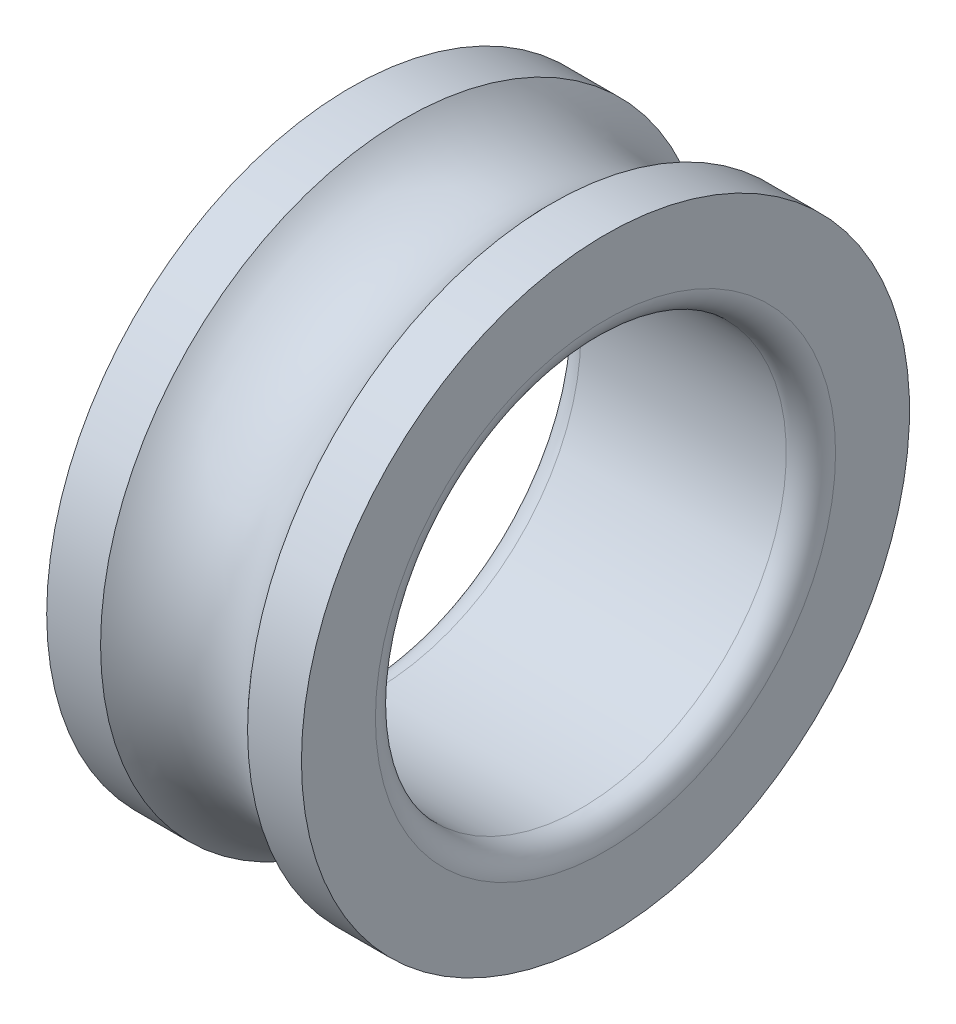
ISO-10303-21;
HEADER;
FILE_DESCRIPTION(('STEP AP214'),'2;1');
FILE_NAME('part.step','',(''),(''),'','','');
FILE_SCHEMA(('AUTOMOTIVE_DESIGN { 1 0 10303 214 1 1 1 1 }'));
ENDSEC;
DATA;
#1=APPLICATION_CONTEXT('core data for automotive mechanical design processes');
#2=APPLICATION_PROTOCOL_DEFINITION('international standard','automotive_design',2000,#1);
#3=PRODUCT_CONTEXT('',#1,'mechanical');
#4=PRODUCT('Part','Part','',(#3));
#5=PRODUCT_RELATED_PRODUCT_CATEGORY('part','',(#4));
#6=PRODUCT_DEFINITION_FORMATION('','',#4);
#7=PRODUCT_DEFINITION_CONTEXT('part definition',#1,'design');
#8=PRODUCT_DEFINITION('design','',#6,#7);
#9=PRODUCT_DEFINITION_SHAPE('','',#8);
#10=(LENGTH_UNIT() NAMED_UNIT(*) SI_UNIT(.MILLI.,.METRE.));
#11=(NAMED_UNIT(*) PLANE_ANGLE_UNIT() SI_UNIT($,.RADIAN.));
#12=(NAMED_UNIT(*) SI_UNIT($,.STERADIAN.) SOLID_ANGLE_UNIT());
#13=UNCERTAINTY_MEASURE_WITH_UNIT(LENGTH_MEASURE(1.E-05),#10,'distance_accuracy_value','');
#14=(GEOMETRIC_REPRESENTATION_CONTEXT(3) GLOBAL_UNCERTAINTY_ASSIGNED_CONTEXT((#13)) GLOBAL_UNIT_ASSIGNED_CONTEXT((#10,
#11,#12)) REPRESENTATION_CONTEXT('',''));
#15=CARTESIAN_POINT('',(0.,0.,0.));
#16=DIRECTION('',(0.,0.,1.));
#17=DIRECTION('',(1.,0.,0.));
#18=AXIS2_PLACEMENT_3D('',#15,#16,#17);
#19=CARTESIAN_POINT('',(-22.6163522012579,0.,0.));
#20=DIRECTION('',(-1.,0.,0.));
#21=DIRECTION('',(0.,0.,1.));
#22=AXIS2_PLACEMENT_3D('',#19,#20,#21);
#23=CYLINDRICAL_SURFACE('',#22,37.);
#24=CARTESIAN_POINT('',(8.94427190999914,0.,0.));
#25=DIRECTION('',(-1.,0.,0.));
#26=DIRECTION('',(0.,0.,1.));
#27=AXIS2_PLACEMENT_3D('',#24,#25,#26);
#28=CIRCLE('',#27,37.);
#29=CARTESIAN_POINT('',(8.94427190999914,0.,37.));
#30=VERTEX_POINT('',#29);
#31=EDGE_CURVE('E61',#30,#30,#28,.T.);
#32=ORIENTED_EDGE('',*,*,#31,.F.);
#33=EDGE_LOOP('',(#32));
#34=FACE_BOUND('',#33,.T.);
#35=CARTESIAN_POINT('',(15.5,0.,0.));
#36=DIRECTION('',(-1.,0.,0.));
#37=DIRECTION('',(0.,0.,1.));
#38=AXIS2_PLACEMENT_3D('',#35,#36,#37);
#39=CIRCLE('',#38,37.);
#40=CARTESIAN_POINT('',(15.5,0.,37.));
#41=VERTEX_POINT('',#40);
#42=EDGE_CURVE('E73',#41,#41,#39,.T.);
#43=ORIENTED_EDGE('',*,*,#42,.T.);
#44=EDGE_LOOP('',(#43));
#45=FACE_BOUND('',#44,.T.);
#46=ADVANCED_FACE('F37',(#34,#45),#23,.T.);
#47=CARTESIAN_POINT('',(0.,0.,0.));
#48=DIRECTION('',(-1.,0.,0.));
#49=DIRECTION('',(0.,0.,1.));
#50=AXIS2_PLACEMENT_3D('',#47,#48,#49);
#51=TOROIDAL_SURFACE('',#50,45.,12.);
#52=CARTESIAN_POINT('',(-8.94427190999917,0.,0.));
#53=DIRECTION('',(-1.,0.,0.));
#54=DIRECTION('',(0.,0.,1.));
#55=AXIS2_PLACEMENT_3D('',#52,#53,#54);
#56=CIRCLE('',#55,37.);
#57=CARTESIAN_POINT('',(-8.94427190999917,0.,37.));
#58=VERTEX_POINT('',#57);
#59=EDGE_CURVE('E65',#58,#58,#56,.T.);
#60=ORIENTED_EDGE('',*,*,#59,.F.);
#61=EDGE_LOOP('',(#60));
#62=FACE_BOUND('',#61,.T.);
#63=ORIENTED_EDGE('',*,*,#31,.T.);
#64=EDGE_LOOP('',(#63));
#65=FACE_BOUND('',#64,.T.);
#66=ADVANCED_FACE('F93',(#62,#65),#51,.F.);
#67=CARTESIAN_POINT('',(-22.6163522012579,0.,0.));
#68=DIRECTION('',(-1.,0.,0.));
#69=DIRECTION('',(0.,0.,1.));
#70=AXIS2_PLACEMENT_3D('',#67,#68,#69);
#71=CYLINDRICAL_SURFACE('',#70,37.);
#72=CARTESIAN_POINT('',(-15.5,0.,0.));
#73=DIRECTION('',(-1.,0.,0.));
#74=DIRECTION('',(0.,0.,1.));
#75=AXIS2_PLACEMENT_3D('',#72,#73,#74);
#76=CIRCLE('',#75,37.);
#77=CARTESIAN_POINT('',(-15.5,0.,37.));
#78=VERTEX_POINT('',#77);
#79=EDGE_CURVE('E69',#78,#78,#76,.T.);
#80=ORIENTED_EDGE('',*,*,#79,.F.);
#81=EDGE_LOOP('',(#80));
#82=FACE_BOUND('',#81,.T.);
#83=ORIENTED_EDGE('',*,*,#59,.T.);
#84=EDGE_LOOP('',(#83));
#85=FACE_BOUND('',#84,.T.);
#86=ADVANCED_FACE('F99',(#82,#85),#71,.T.);
#87=CARTESIAN_POINT('',(-15.5,25.,0.));
#88=DIRECTION('',(1.,0.,0.));
#89=DIRECTION('',(0.,0.,-1.));
#90=AXIS2_PLACEMENT_3D('',#87,#88,#89);
#91=PLANE('',#90);
#92=CARTESIAN_POINT('',(-15.5,0.,0.));
#93=DIRECTION('',(1.,0.,0.));
#94=DIRECTION('',(0.,0.,-1.));
#95=AXIS2_PLACEMENT_3D('',#92,#93,#94);
#96=CIRCLE('',#95,28.);
#97=CARTESIAN_POINT('',(-15.5,0.,-28.));
#98=VERTEX_POINT('',#97);
#99=EDGE_CURVE('E45',#98,#98,#96,.T.);
#100=ORIENTED_EDGE('',*,*,#99,.T.);
#101=EDGE_LOOP('',(#100));
#102=FACE_BOUND('',#101,.T.);
#103=ORIENTED_EDGE('',*,*,#79,.T.);
#104=EDGE_LOOP('',(#103));
#105=FACE_BOUND('',#104,.T.);
#106=ADVANCED_FACE('F89',(#102,#105),#91,.F.);
#107=CARTESIAN_POINT('',(-22.6163522012579,0.,0.));
#108=DIRECTION('',(-1.,0.,0.));
#109=DIRECTION('',(0.,0.,1.));
#110=AXIS2_PLACEMENT_3D('',#107,#108,#109);
#111=CYLINDRICAL_SURFACE('',#110,25.);
#112=CARTESIAN_POINT('',(-12.5,0.,0.));
#113=DIRECTION('',(1.,0.,0.));
#114=DIRECTION('',(0.,0.,-1.));
#115=AXIS2_PLACEMENT_3D('',#112,#113,#114);
#116=CIRCLE('',#115,25.);
#117=CARTESIAN_POINT('',(-12.5,0.,-25.));
#118=VERTEX_POINT('',#117);
#119=EDGE_CURVE('E50',#118,#118,#116,.F.);
#120=ORIENTED_EDGE('',*,*,#119,.T.);
#121=EDGE_LOOP('',(#120));
#122=FACE_BOUND('',#121,.T.);
#123=CARTESIAN_POINT('',(12.5,0.,0.));
#124=DIRECTION('',(-1.,0.,0.));
#125=DIRECTION('',(0.,0.,1.));
#126=AXIS2_PLACEMENT_3D('',#123,#124,#125);
#127=CIRCLE('',#126,25.);
#128=CARTESIAN_POINT('',(12.5,0.,25.));
#129=VERTEX_POINT('',#128);
#130=EDGE_CURVE('E55',#129,#129,#127,.F.);
#131=ORIENTED_EDGE('',*,*,#130,.T.);
#132=EDGE_LOOP('',(#131));
#133=FACE_BOUND('',#132,.T.);
#134=ADVANCED_FACE('F82',(#122,#133),#111,.F.);
#135=CARTESIAN_POINT('',(15.5,25.,0.));
#136=DIRECTION('',(-1.,0.,0.));
#137=DIRECTION('',(0.,0.,1.));
#138=AXIS2_PLACEMENT_3D('',#135,#136,#137);
#139=PLANE('',#138);
#140=CARTESIAN_POINT('',(15.5,0.,0.));
#141=DIRECTION('',(-1.,0.,0.));
#142=DIRECTION('',(0.,0.,1.));
#143=AXIS2_PLACEMENT_3D('',#140,#141,#142);
#144=CIRCLE('',#143,28.);
#145=CARTESIAN_POINT('',(15.5,0.,28.));
#146=VERTEX_POINT('',#145);
#147=EDGE_CURVE('E10',#146,#146,#144,.T.);
#148=ORIENTED_EDGE('',*,*,#147,.T.);
#149=EDGE_LOOP('',(#148));
#150=FACE_BOUND('',#149,.T.);
#151=ORIENTED_EDGE('',*,*,#42,.F.);
#152=EDGE_LOOP('',(#151));
#153=FACE_BOUND('',#152,.T.);
#154=ADVANCED_FACE('F79',(#150,#153),#139,.F.);
#155=CARTESIAN_POINT('',(-12.5,0.,0.));
#156=DIRECTION('',(1.,0.,0.));
#157=DIRECTION('',(0.,0.,-1.));
#158=AXIS2_PLACEMENT_3D('',#155,#156,#157);
#159=TOROIDAL_SURFACE('',#158,28.,3.);
#160=ORIENTED_EDGE('',*,*,#99,.F.);
#161=EDGE_LOOP('',(#160));
#162=FACE_BOUND('',#161,.T.);
#163=ORIENTED_EDGE('',*,*,#119,.F.);
#164=EDGE_LOOP('',(#163));
#165=FACE_BOUND('',#164,.T.);
#166=ADVANCED_FACE('F81',(#162,#165),#159,.T.);
#167=CARTESIAN_POINT('',(12.5,0.,0.));
#168=DIRECTION('',(-1.,0.,0.));
#169=DIRECTION('',(0.,0.,1.));
#170=AXIS2_PLACEMENT_3D('',#167,#168,#169);
#171=TOROIDAL_SURFACE('',#170,28.,3.);
#172=ORIENTED_EDGE('',*,*,#130,.F.);
#173=EDGE_LOOP('',(#172));
#174=FACE_BOUND('',#173,.T.);
#175=ORIENTED_EDGE('',*,*,#147,.F.);
#176=EDGE_LOOP('',(#175));
#177=FACE_BOUND('',#176,.T.);
#178=ADVANCED_FACE('F39',(#174,#177),#171,.T.);
#179=CLOSED_SHELL('',(#46,#66,#86,#106,#134,#154,#166,#178));
#180=MANIFOLD_SOLID_BREP('B2',#179);
#181=ADVANCED_BREP_SHAPE_REPRESENTATION('',(#18,#180),#14);
#182=SHAPE_DEFINITION_REPRESENTATION(#9,#181);
ENDSEC;
END-ISO-10303-21;
